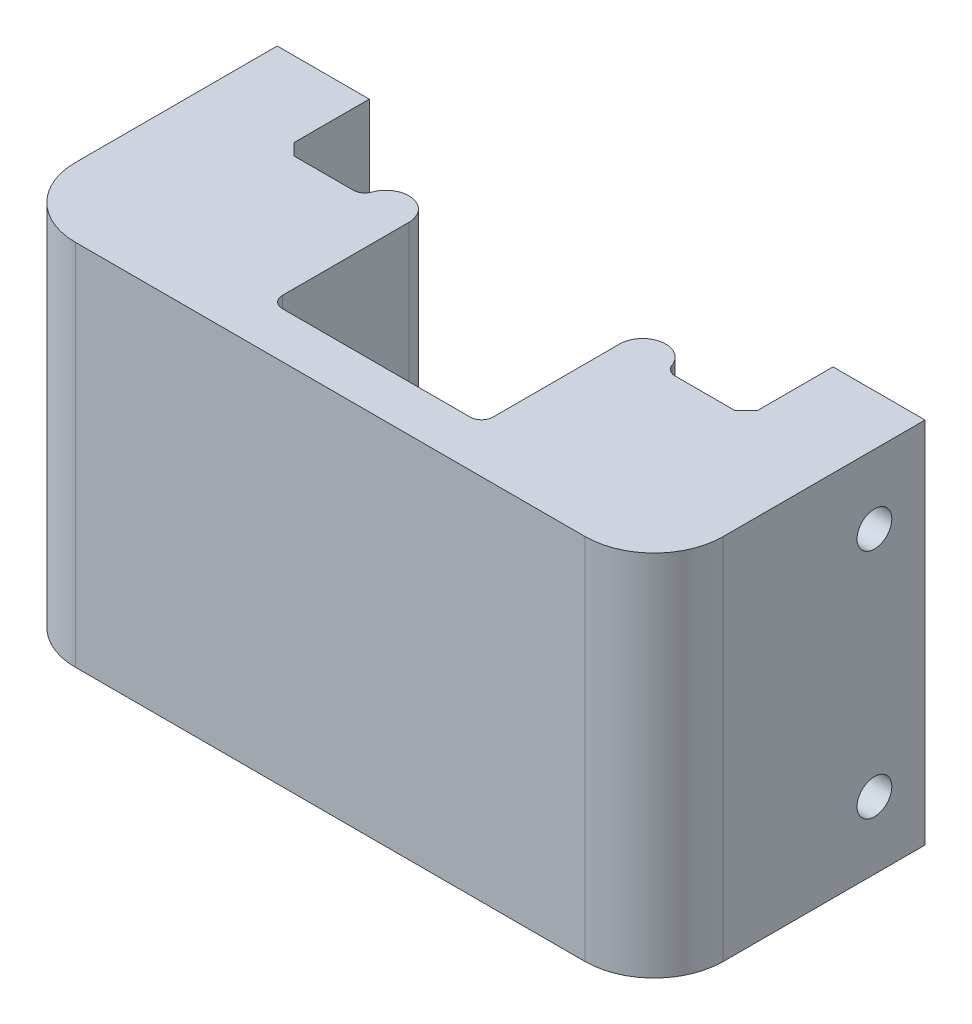
ISO-10303-21;
HEADER;
FILE_DESCRIPTION(('STEP AP214'),'2;1');
FILE_NAME('part.step','',(''),(''),'','','');
FILE_SCHEMA(('AUTOMOTIVE_DESIGN { 1 0 10303 214 1 1 1 1 }'));
ENDSEC;
DATA;
#1=APPLICATION_CONTEXT('core data for automotive mechanical design processes');
#2=APPLICATION_PROTOCOL_DEFINITION('international standard','automotive_design',2000,#1);
#3=PRODUCT_CONTEXT('',#1,'mechanical');
#4=PRODUCT('Part','Part','',(#3));
#5=PRODUCT_RELATED_PRODUCT_CATEGORY('part','',(#4));
#6=PRODUCT_DEFINITION_FORMATION('','',#4);
#7=PRODUCT_DEFINITION_CONTEXT('part definition',#1,'design');
#8=PRODUCT_DEFINITION('design','',#6,#7);
#9=PRODUCT_DEFINITION_SHAPE('','',#8);
#10=(LENGTH_UNIT() NAMED_UNIT(*) SI_UNIT(.MILLI.,.METRE.));
#11=(NAMED_UNIT(*) PLANE_ANGLE_UNIT() SI_UNIT($,.RADIAN.));
#12=(NAMED_UNIT(*) SI_UNIT($,.STERADIAN.) SOLID_ANGLE_UNIT());
#13=UNCERTAINTY_MEASURE_WITH_UNIT(LENGTH_MEASURE(1.E-05),#10,'distance_accuracy_value','');
#14=(GEOMETRIC_REPRESENTATION_CONTEXT(3) GLOBAL_UNCERTAINTY_ASSIGNED_CONTEXT((#13)) GLOBAL_UNIT_ASSIGNED_CONTEXT((#10,
#11,#12)) REPRESENTATION_CONTEXT('',''));
#15=CARTESIAN_POINT('',(0.,0.,0.));
#16=DIRECTION('',(0.,0.,1.));
#17=DIRECTION('',(1.,0.,0.));
#18=AXIS2_PLACEMENT_3D('',#15,#16,#17);
#19=CARTESIAN_POINT('',(24.86025,0.,0.));
#20=DIRECTION('',(0.,-1.,0.));
#21=DIRECTION('',(0.,0.,-1.));
#22=AXIS2_PLACEMENT_3D('',#19,#20,#21);
#23=CYLINDRICAL_SURFACE('',#22,1.5875);
#24=CARTESIAN_POINT('',(24.86025,25.4,0.));
#25=DIRECTION('',(0.,1.,0.));
#26=DIRECTION('',(0.,0.,1.));
#27=AXIS2_PLACEMENT_3D('',#24,#25,#26);
#28=CIRCLE('',#27,1.5875);
#29=CARTESIAN_POINT('',(26.3569593535115,25.4,-0.529166666666667));
#30=VERTEX_POINT('',#29);
#31=CARTESIAN_POINT('',(23.27275,25.4,0.));
#32=VERTEX_POINT('',#31);
#33=EDGE_CURVE('E342',#30,#32,#28,.T.);
#34=ORIENTED_EDGE('',*,*,#33,.F.);
#35=DIRECTION('',(0.,-1.,0.));
#36=VECTOR('',#35,1.);
#37=CARTESIAN_POINT('',(26.3569593535115,0.,-0.529166666666667));
#38=LINE('',#37,#36);
#39=CARTESIAN_POINT('',(26.3569593535115,0.,-0.529166666666667));
#40=VERTEX_POINT('',#39);
#41=EDGE_CURVE('E349',#30,#40,#38,.T.);
#42=ORIENTED_EDGE('',*,*,#41,.T.);
#43=CARTESIAN_POINT('',(24.86025,0.,0.));
#44=DIRECTION('',(0.,1.,0.));
#45=DIRECTION('',(0.,0.,1.));
#46=AXIS2_PLACEMENT_3D('',#43,#44,#45);
#47=CIRCLE('',#46,1.5875);
#48=CARTESIAN_POINT('',(23.27275,0.,0.));
#49=VERTEX_POINT('',#48);
#50=EDGE_CURVE('E340',#49,#40,#47,.F.);
#51=ORIENTED_EDGE('',*,*,#50,.F.);
#52=DIRECTION('',(0.,1.,0.));
#53=VECTOR('',#52,1.);
#54=CARTESIAN_POINT('',(23.27275,0.,0.));
#55=LINE('',#54,#53);
#56=EDGE_CURVE('E337',#32,#49,#55,.F.);
#57=ORIENTED_EDGE('',*,*,#56,.F.);
#58=EDGE_LOOP('',(#34,#42,#51,#57));
#59=FACE_BOUND('',#58,.T.);
#60=ADVANCED_FACE('F38',(#59),#23,.T.);
#61=CARTESIAN_POINT('',(7.14375,25.4,0.));
#62=DIRECTION('',(0.,-1.,0.));
#63=DIRECTION('',(0.,0.,-1.));
#64=AXIS2_PLACEMENT_3D('',#61,#62,#63);
#65=CYLINDRICAL_SURFACE('',#64,1.5875);
#66=CARTESIAN_POINT('',(7.14375,0.,0.));
#67=DIRECTION('',(0.,1.,0.));
#68=DIRECTION('',(0.,0.,1.));
#69=AXIS2_PLACEMENT_3D('',#66,#67,#68);
#70=CIRCLE('',#69,1.5875);
#71=CARTESIAN_POINT('',(5.64704064648847,0.,-0.529166666666667));
#72=VERTEX_POINT('',#71);
#73=CARTESIAN_POINT('',(8.73125,0.,0.));
#74=VERTEX_POINT('',#73);
#75=EDGE_CURVE('E335',#72,#74,#70,.F.);
#76=ORIENTED_EDGE('',*,*,#75,.F.);
#77=DIRECTION('',(0.,-1.,0.));
#78=VECTOR('',#77,1.);
#79=CARTESIAN_POINT('',(5.64704064648847,25.4,-0.529166666666667));
#80=LINE('',#79,#78);
#81=CARTESIAN_POINT('',(5.64704064648847,25.4,-0.529166666666667));
#82=VERTEX_POINT('',#81);
#83=EDGE_CURVE('E347',#72,#82,#80,.F.);
#84=ORIENTED_EDGE('',*,*,#83,.T.);
#85=CARTESIAN_POINT('',(7.14375,25.4,0.));
#86=DIRECTION('',(0.,1.,0.));
#87=DIRECTION('',(0.,0.,1.));
#88=AXIS2_PLACEMENT_3D('',#85,#86,#87);
#89=CIRCLE('',#88,1.5875);
#90=CARTESIAN_POINT('',(8.73125,25.4,0.));
#91=VERTEX_POINT('',#90);
#92=EDGE_CURVE('E332',#91,#82,#89,.T.);
#93=ORIENTED_EDGE('',*,*,#92,.F.);
#94=DIRECTION('',(0.,1.,0.));
#95=VECTOR('',#94,1.);
#96=CARTESIAN_POINT('',(8.73125,25.4,0.));
#97=LINE('',#96,#95);
#98=EDGE_CURVE('E329',#74,#91,#97,.T.);
#99=ORIENTED_EDGE('',*,*,#98,.F.);
#100=EDGE_LOOP('',(#76,#84,#93,#99));
#101=FACE_BOUND('',#100,.T.);
#102=ADVANCED_FACE('F372',(#101),#65,.T.);
#103=CARTESIAN_POINT('',(0.,25.4,12.7));
#104=DIRECTION('',(0.,0.,-1.));
#105=DIRECTION('',(-1.,0.,0.));
#106=AXIS2_PLACEMENT_3D('',#103,#104,#105);
#107=PLANE('',#106);
#108=DIRECTION('',(1.,0.,0.));
#109=VECTOR('',#108,1.);
#110=CARTESIAN_POINT('',(0.,0.,12.7));
#111=LINE('',#110,#109);
#112=CARTESIAN_POINT('',(-1.5875,0.,12.7));
#113=VERTEX_POINT('',#112);
#114=CARTESIAN_POINT('',(33.5915,0.,12.7));
#115=VERTEX_POINT('',#114);
#116=EDGE_CURVE('E244',#113,#115,#111,.T.);
#117=ORIENTED_EDGE('',*,*,#116,.T.);
#118=DIRECTION('',(0.,-1.,0.));
#119=VECTOR('',#118,1.);
#120=CARTESIAN_POINT('',(33.5915,25.4,12.7));
#121=LINE('',#120,#119);
#122=CARTESIAN_POINT('',(33.5915,25.4,12.7));
#123=VERTEX_POINT('',#122);
#124=EDGE_CURVE('E322',#115,#123,#121,.F.);
#125=ORIENTED_EDGE('',*,*,#124,.T.);
#126=DIRECTION('',(1.,0.,0.));
#127=VECTOR('',#126,1.);
#128=CARTESIAN_POINT('',(0.,25.4,12.7));
#129=LINE('',#128,#127);
#130=CARTESIAN_POINT('',(-1.5875,25.4,12.7));
#131=VERTEX_POINT('',#130);
#132=EDGE_CURVE('E208',#131,#123,#129,.T.);
#133=ORIENTED_EDGE('',*,*,#132,.F.);
#134=DIRECTION('',(0.,-1.,0.));
#135=VECTOR('',#134,1.);
#136=CARTESIAN_POINT('',(-1.5875,25.4,12.7));
#137=LINE('',#136,#135);
#138=EDGE_CURVE('E319',#131,#113,#137,.T.);
#139=ORIENTED_EDGE('',*,*,#138,.T.);
#140=EDGE_LOOP('',(#117,#125,#133,#139));
#141=FACE_BOUND('',#140,.T.);
#142=ADVANCED_FACE('F412',(#141),#107,.F.);
#143=CARTESIAN_POINT('',(38.354,25.4,0.));
#144=DIRECTION('',(1.,0.,0.));
#145=DIRECTION('',(0.,0.,-1.));
#146=AXIS2_PLACEMENT_3D('',#143,#144,#145);
#147=PLANE('',#146);
#148=CARTESIAN_POINT('',(38.354,4.63906250000029,-2.49999999999964));
#149=DIRECTION('',(-1.,0.,0.));
#150=DIRECTION('',(0.,0.,1.));
#151=AXIS2_PLACEMENT_3D('',#148,#149,#150);
#152=CIRCLE('',#151,1.2);
#153=CARTESIAN_POINT('',(38.354,4.63906250000029,-1.29999999999965));
#154=VERTEX_POINT('',#153);
#155=EDGE_CURVE('E540',#154,#154,#152,.T.);
#156=ORIENTED_EDGE('',*,*,#155,.T.);
#157=EDGE_LOOP('',(#156));
#158=FACE_BOUND('',#157,.T.);
#159=CARTESIAN_POINT('',(38.354,20.6390625000002,-2.49999999999957));
#160=DIRECTION('',(-1.,0.,0.));
#161=DIRECTION('',(0.,0.,1.));
#162=AXIS2_PLACEMENT_3D('',#159,#160,#161);
#163=CIRCLE('',#162,1.2);
#164=CARTESIAN_POINT('',(38.354,20.6390625000002,-1.29999999999957));
#165=VERTEX_POINT('',#164);
#166=EDGE_CURVE('E534',#165,#165,#163,.T.);
#167=ORIENTED_EDGE('',*,*,#166,.T.);
#168=EDGE_LOOP('',(#167));
#169=FACE_BOUND('',#168,.T.);
#170=DIRECTION('',(0.,0.,1.));
#171=VECTOR('',#170,1.);
#172=CARTESIAN_POINT('',(38.354,25.4,0.));
#173=LINE('',#172,#171);
#174=CARTESIAN_POINT('',(38.354,25.4,-5.9944));
#175=VERTEX_POINT('',#174);
#176=CARTESIAN_POINT('',(38.354,25.4,7.9375));
#177=VERTEX_POINT('',#176);
#178=EDGE_CURVE('E189',#175,#177,#173,.T.);
#179=ORIENTED_EDGE('',*,*,#178,.T.);
#180=DIRECTION('',(0.,-1.,0.));
#181=VECTOR('',#180,1.);
#182=CARTESIAN_POINT('',(38.354,0.,7.9375));
#183=LINE('',#182,#181);
#184=CARTESIAN_POINT('',(38.354,0.,7.9375));
#185=VERTEX_POINT('',#184);
#186=EDGE_CURVE('E313',#177,#185,#183,.T.);
#187=ORIENTED_EDGE('',*,*,#186,.T.);
#188=DIRECTION('',(0.,0.,1.));
#189=VECTOR('',#188,1.);
#190=CARTESIAN_POINT('',(38.354,0.,0.));
#191=LINE('',#190,#189);
#192=CARTESIAN_POINT('',(38.354,0.,-5.9944));
#193=VERTEX_POINT('',#192);
#194=EDGE_CURVE('E192',#193,#185,#191,.T.);
#195=ORIENTED_EDGE('',*,*,#194,.F.);
#196=DIRECTION('',(0.,-1.,0.));
#197=VECTOR('',#196,1.);
#198=CARTESIAN_POINT('',(38.354,25.4,-5.9944));
#199=LINE('',#198,#197);
#200=EDGE_CURVE('E185',#175,#193,#199,.T.);
#201=ORIENTED_EDGE('',*,*,#200,.F.);
#202=EDGE_LOOP('',(#179,#187,#195,#201));
#203=FACE_BOUND('',#202,.T.);
#204=ADVANCED_FACE('F187',(#158,#169,#203),#147,.T.);
#205=CARTESIAN_POINT('',(0.,25.4,-5.9944));
#206=DIRECTION('',(0.,0.,-1.));
#207=DIRECTION('',(-1.,0.,0.));
#208=AXIS2_PLACEMENT_3D('',#205,#206,#207);
#209=PLANE('',#208);
#210=DIRECTION('',(1.,0.,0.));
#211=VECTOR('',#210,1.);
#212=CARTESIAN_POINT('',(0.,0.,-5.9944));
#213=LINE('',#212,#211);
#214=CARTESIAN_POINT('',(32.004,0.,-5.9944));
#215=VERTEX_POINT('',#214);
#216=EDGE_CURVE('E249',#215,#193,#213,.T.);
#217=ORIENTED_EDGE('',*,*,#216,.F.);
#218=DIRECTION('',(0.,-1.,0.));
#219=VECTOR('',#218,1.);
#220=CARTESIAN_POINT('',(32.004,25.4,-5.9944));
#221=LINE('',#220,#219);
#222=CARTESIAN_POINT('',(32.004,25.4,-5.9944));
#223=VERTEX_POINT('',#222);
#224=EDGE_CURVE('E198',#223,#215,#221,.T.);
#225=ORIENTED_EDGE('',*,*,#224,.F.);
#226=DIRECTION('',(1.,0.,0.));
#227=VECTOR('',#226,1.);
#228=CARTESIAN_POINT('',(0.,25.4,-5.9944));
#229=LINE('',#228,#227);
#230=EDGE_CURVE('E204',#223,#175,#229,.T.);
#231=ORIENTED_EDGE('',*,*,#230,.T.);
#232=ORIENTED_EDGE('',*,*,#200,.T.);
#233=EDGE_LOOP('',(#217,#225,#231,#232));
#234=FACE_BOUND('',#233,.T.);
#235=ADVANCED_FACE('F211',(#234),#209,.T.);
#236=CARTESIAN_POINT('',(32.004,25.4,0.));
#237=DIRECTION('',(-1.,0.,0.));
#238=DIRECTION('',(0.,0.,1.));
#239=AXIS2_PLACEMENT_3D('',#236,#237,#238);
#240=PLANE('',#239);
#241=CARTESIAN_POINT('',(32.004,4.63906250000029,-2.49999999999964));
#242=DIRECTION('',(-1.,0.,0.));
#243=DIRECTION('',(0.,0.,1.));
#244=AXIS2_PLACEMENT_3D('',#241,#242,#243);
#245=CIRCLE('',#244,1.2);
#246=CARTESIAN_POINT('',(32.004,4.63906250000029,-1.29999999999965));
#247=VERTEX_POINT('',#246);
#248=EDGE_CURVE('E543',#247,#247,#245,.T.);
#249=ORIENTED_EDGE('',*,*,#248,.F.);
#250=EDGE_LOOP('',(#249));
#251=FACE_BOUND('',#250,.T.);
#252=CARTESIAN_POINT('',(32.004,20.6390625000002,-2.49999999999957));
#253=DIRECTION('',(-1.,0.,0.));
#254=DIRECTION('',(0.,0.,1.));
#255=AXIS2_PLACEMENT_3D('',#252,#253,#254);
#256=CIRCLE('',#255,1.2);
#257=CARTESIAN_POINT('',(32.004,20.6390625000002,-1.29999999999957));
#258=VERTEX_POINT('',#257);
#259=EDGE_CURVE('E537',#258,#258,#256,.T.);
#260=ORIENTED_EDGE('',*,*,#259,.F.);
#261=EDGE_LOOP('',(#260));
#262=FACE_BOUND('',#261,.T.);
#263=DIRECTION('',(0.,0.,-1.));
#264=VECTOR('',#263,1.);
#265=CARTESIAN_POINT('',(32.004,0.,0.));
#266=LINE('',#265,#264);
#267=CARTESIAN_POINT('',(32.004,0.,-0.793750000000003));
#268=VERTEX_POINT('',#267);
#269=EDGE_CURVE('E251',#268,#215,#266,.T.);
#270=ORIENTED_EDGE('',*,*,#269,.F.);
#271=DIRECTION('',(0.,1.,0.));
#272=VECTOR('',#271,1.);
#273=CARTESIAN_POINT('',(32.004,25.4,-0.793750000000003));
#274=LINE('',#273,#272);
#275=CARTESIAN_POINT('',(32.004,25.4,-0.793750000000003));
#276=VERTEX_POINT('',#275);
#277=EDGE_CURVE('E295',#268,#276,#274,.T.);
#278=ORIENTED_EDGE('',*,*,#277,.T.);
#279=DIRECTION('',(0.,0.,-1.));
#280=VECTOR('',#279,1.);
#281=CARTESIAN_POINT('',(32.004,25.4,0.));
#282=LINE('',#281,#280);
#283=EDGE_CURVE('E213',#276,#223,#282,.T.);
#284=ORIENTED_EDGE('',*,*,#283,.T.);
#285=ORIENTED_EDGE('',*,*,#224,.T.);
#286=EDGE_LOOP('',(#270,#278,#284,#285));
#287=FACE_BOUND('',#286,.T.);
#288=ADVANCED_FACE('F407',(#251,#262,#287),#240,.T.);
#289=CARTESIAN_POINT('',(0.,25.4,0.));
#290=DIRECTION('',(0.,0.,-1.));
#291=DIRECTION('',(-1.,0.,0.));
#292=AXIS2_PLACEMENT_3D('',#289,#290,#291);
#293=PLANE('',#292);
#294=DIRECTION('',(1.,0.,0.));
#295=VECTOR('',#294,1.);
#296=CARTESIAN_POINT('',(0.,0.,0.));
#297=LINE('',#296,#295);
#298=CARTESIAN_POINT('',(27.1053140302673,0.,0.));
#299=VERTEX_POINT('',#298);
#300=CARTESIAN_POINT('',(31.21025,0.,0.));
#301=VERTEX_POINT('',#300);
#302=EDGE_CURVE('E253',#299,#301,#297,.T.);
#303=ORIENTED_EDGE('',*,*,#302,.F.);
#304=DIRECTION('',(0.,1.,0.));
#305=VECTOR('',#304,1.);
#306=CARTESIAN_POINT('',(27.1053140302673,25.4,0.));
#307=LINE('',#306,#305);
#308=CARTESIAN_POINT('',(27.1053140302673,25.4,0.));
#309=VERTEX_POINT('',#308);
#310=EDGE_CURVE('E59',#299,#309,#307,.T.);
#311=ORIENTED_EDGE('',*,*,#310,.T.);
#312=DIRECTION('',(1.,0.,0.));
#313=VECTOR('',#312,1.);
#314=CARTESIAN_POINT('',(0.,25.4,0.));
#315=LINE('',#314,#313);
#316=CARTESIAN_POINT('',(31.21025,25.4,0.));
#317=VERTEX_POINT('',#316);
#318=EDGE_CURVE('E215',#309,#317,#315,.T.);
#319=ORIENTED_EDGE('',*,*,#318,.T.);
#320=DIRECTION('',(0.,-1.,0.));
#321=VECTOR('',#320,1.);
#322=CARTESIAN_POINT('',(31.21025,0.,0.));
#323=LINE('',#322,#321);
#324=EDGE_CURVE('E197',#317,#301,#323,.T.);
#325=ORIENTED_EDGE('',*,*,#324,.T.);
#326=EDGE_LOOP('',(#303,#311,#319,#325));
#327=FACE_BOUND('',#326,.T.);
#328=ADVANCED_FACE('F400',(#327),#293,.T.);
#329=CARTESIAN_POINT('',(23.27275,25.4,0.));
#330=DIRECTION('',(-1.,0.,0.));
#331=DIRECTION('',(0.,0.,1.));
#332=AXIS2_PLACEMENT_3D('',#329,#330,#331);
#333=PLANE('',#332);
#334=DIRECTION('',(0.,0.,-1.));
#335=VECTOR('',#334,1.);
#336=CARTESIAN_POINT('',(23.27275,25.4,0.));
#337=LINE('',#336,#335);
#338=CARTESIAN_POINT('',(23.27275,25.4,8.73125));
#339=VERTEX_POINT('',#338);
#340=EDGE_CURVE('E220',#339,#32,#337,.T.);
#341=ORIENTED_EDGE('',*,*,#340,.T.);
#342=ORIENTED_EDGE('',*,*,#56,.T.);
#343=DIRECTION('',(0.,0.,-1.));
#344=VECTOR('',#343,1.);
#345=CARTESIAN_POINT('',(23.27275,0.,0.));
#346=LINE('',#345,#344);
#347=CARTESIAN_POINT('',(23.27275,0.,8.73125));
#348=VERTEX_POINT('',#347);
#349=EDGE_CURVE('E255',#348,#49,#346,.T.);
#350=ORIENTED_EDGE('',*,*,#349,.F.);
#351=DIRECTION('',(0.,-1.,0.));
#352=VECTOR('',#351,1.);
#353=CARTESIAN_POINT('',(23.27275,25.4,8.73125));
#354=LINE('',#353,#352);
#355=EDGE_CURVE('E290',#339,#348,#354,.T.);
#356=ORIENTED_EDGE('',*,*,#355,.F.);
#357=EDGE_LOOP('',(#341,#342,#350,#356));
#358=FACE_BOUND('',#357,.T.);
#359=ADVANCED_FACE('F390',(#358),#333,.T.);
#360=CARTESIAN_POINT('',(22.479,25.4,8.73125));
#361=DIRECTION('',(0.,-1.,0.));
#362=DIRECTION('',(0.,0.,-1.));
#363=AXIS2_PLACEMENT_3D('',#360,#361,#362);
#364=CYLINDRICAL_SURFACE('',#363,0.793750000000001);
#365=CARTESIAN_POINT('',(22.479,0.,8.73125));
#366=DIRECTION('',(0.,1.,0.));
#367=DIRECTION('',(0.,0.,1.));
#368=AXIS2_PLACEMENT_3D('',#365,#366,#367);
#369=CIRCLE('',#368,0.793750000000001);
#370=CARTESIAN_POINT('',(22.479,0.,9.525));
#371=VERTEX_POINT('',#370);
#372=EDGE_CURVE('E258',#371,#348,#369,.T.);
#373=ORIENTED_EDGE('',*,*,#372,.F.);
#374=DIRECTION('',(0.,-1.,0.));
#375=VECTOR('',#374,1.);
#376=CARTESIAN_POINT('',(22.479,25.4,9.525));
#377=LINE('',#376,#375);
#378=CARTESIAN_POINT('',(22.479,25.4,9.525));
#379=VERTEX_POINT('',#378);
#380=EDGE_CURVE('E288',#379,#371,#377,.T.);
#381=ORIENTED_EDGE('',*,*,#380,.F.);
#382=CARTESIAN_POINT('',(22.479,25.4,8.73125));
#383=DIRECTION('',(0.,1.,0.));
#384=DIRECTION('',(0.,0.,1.));
#385=AXIS2_PLACEMENT_3D('',#382,#383,#384);
#386=CIRCLE('',#385,0.793750000000001);
#387=EDGE_CURVE('E223',#379,#339,#386,.T.);
#388=ORIENTED_EDGE('',*,*,#387,.T.);
#389=ORIENTED_EDGE('',*,*,#355,.T.);
#390=EDGE_LOOP('',(#373,#381,#388,#389));
#391=FACE_BOUND('',#390,.T.);
#392=ADVANCED_FACE('F387',(#391),#364,.F.);
#393=CARTESIAN_POINT('',(0.,25.4,9.525));
#394=DIRECTION('',(0.,0.,-1.));
#395=DIRECTION('',(-1.,0.,0.));
#396=AXIS2_PLACEMENT_3D('',#393,#394,#395);
#397=PLANE('',#396);
#398=DIRECTION('',(1.,0.,0.));
#399=VECTOR('',#398,1.);
#400=CARTESIAN_POINT('',(0.,0.,9.525));
#401=LINE('',#400,#399);
#402=CARTESIAN_POINT('',(9.525,0.,9.525));
#403=VERTEX_POINT('',#402);
#404=EDGE_CURVE('E261',#403,#371,#401,.T.);
#405=ORIENTED_EDGE('',*,*,#404,.F.);
#406=DIRECTION('',(0.,-1.,0.));
#407=VECTOR('',#406,1.);
#408=CARTESIAN_POINT('',(9.525,25.4,9.525));
#409=LINE('',#408,#407);
#410=CARTESIAN_POINT('',(9.525,25.4,9.525));
#411=VERTEX_POINT('',#410);
#412=EDGE_CURVE('E286',#411,#403,#409,.T.);
#413=ORIENTED_EDGE('',*,*,#412,.F.);
#414=DIRECTION('',(1.,0.,0.));
#415=VECTOR('',#414,1.);
#416=CARTESIAN_POINT('',(0.,25.4,9.525));
#417=LINE('',#416,#415);
#418=EDGE_CURVE('E226',#411,#379,#417,.T.);
#419=ORIENTED_EDGE('',*,*,#418,.T.);
#420=ORIENTED_EDGE('',*,*,#380,.T.);
#421=EDGE_LOOP('',(#405,#413,#419,#420));
#422=FACE_BOUND('',#421,.T.);
#423=ADVANCED_FACE('F381',(#422),#397,.T.);
#424=CARTESIAN_POINT('',(9.525,25.4,8.73125));
#425=DIRECTION('',(0.,-1.,0.));
#426=DIRECTION('',(0.,0.,-1.));
#427=AXIS2_PLACEMENT_3D('',#424,#425,#426);
#428=CYLINDRICAL_SURFACE('',#427,0.793749999999999);
#429=CARTESIAN_POINT('',(9.525,0.,8.73125));
#430=DIRECTION('',(0.,1.,0.));
#431=DIRECTION('',(0.,0.,1.));
#432=AXIS2_PLACEMENT_3D('',#429,#430,#431);
#433=CIRCLE('',#432,0.793749999999999);
#434=CARTESIAN_POINT('',(8.73125,0.,8.73125));
#435=VERTEX_POINT('',#434);
#436=EDGE_CURVE('E264',#403,#435,#433,.F.);
#437=ORIENTED_EDGE('',*,*,#436,.T.);
#438=DIRECTION('',(0.,-1.,0.));
#439=VECTOR('',#438,1.);
#440=CARTESIAN_POINT('',(8.73125,25.4,8.73125));
#441=LINE('',#440,#439);
#442=CARTESIAN_POINT('',(8.73125,25.4,8.73125));
#443=VERTEX_POINT('',#442);
#444=EDGE_CURVE('E283',#443,#435,#441,.T.);
#445=ORIENTED_EDGE('',*,*,#444,.F.);
#446=CARTESIAN_POINT('',(9.525,25.4,8.73125));
#447=DIRECTION('',(0.,1.,0.));
#448=DIRECTION('',(0.,0.,1.));
#449=AXIS2_PLACEMENT_3D('',#446,#447,#448);
#450=CIRCLE('',#449,0.793749999999999);
#451=EDGE_CURVE('E229',#411,#443,#450,.F.);
#452=ORIENTED_EDGE('',*,*,#451,.F.);
#453=ORIENTED_EDGE('',*,*,#412,.T.);
#454=EDGE_LOOP('',(#437,#445,#452,#453));
#455=FACE_BOUND('',#454,.T.);
#456=ADVANCED_FACE('F483',(#455),#428,.F.);
#457=CARTESIAN_POINT('',(8.73125,25.4,0.));
#458=DIRECTION('',(-1.,0.,0.));
#459=DIRECTION('',(0.,0.,1.));
#460=AXIS2_PLACEMENT_3D('',#457,#458,#459);
#461=PLANE('',#460);
#462=DIRECTION('',(0.,0.,-1.));
#463=VECTOR('',#462,1.);
#464=CARTESIAN_POINT('',(8.73125,0.,0.));
#465=LINE('',#464,#463);
#466=EDGE_CURVE('E266',#435,#74,#465,.T.);
#467=ORIENTED_EDGE('',*,*,#466,.T.);
#468=ORIENTED_EDGE('',*,*,#98,.T.);
#469=DIRECTION('',(0.,0.,-1.));
#470=VECTOR('',#469,1.);
#471=CARTESIAN_POINT('',(8.73125,25.4,0.));
#472=LINE('',#471,#470);
#473=EDGE_CURVE('E231',#443,#91,#472,.T.);
#474=ORIENTED_EDGE('',*,*,#473,.F.);
#475=ORIENTED_EDGE('',*,*,#444,.T.);
#476=EDGE_LOOP('',(#467,#468,#474,#475));
#477=FACE_BOUND('',#476,.T.);
#478=ADVANCED_FACE('F375',(#477),#461,.F.);
#479=CARTESIAN_POINT('',(0.,25.4,0.));
#480=DIRECTION('',(0.,0.,1.));
#481=DIRECTION('',(1.,0.,0.));
#482=AXIS2_PLACEMENT_3D('',#479,#480,#481);
#483=PLANE('',#482);
#484=DIRECTION('',(-1.,0.,0.));
#485=VECTOR('',#484,1.);
#486=CARTESIAN_POINT('',(0.,25.4,0.));
#487=LINE('',#486,#485);
#488=CARTESIAN_POINT('',(4.89868596973271,25.4,0.));
#489=VERTEX_POINT('',#488);
#490=CARTESIAN_POINT('',(0.793750000000003,25.4,0.));
#491=VERTEX_POINT('',#490);
#492=EDGE_CURVE('E234',#489,#491,#487,.T.);
#493=ORIENTED_EDGE('',*,*,#492,.F.);
#494=DIRECTION('',(0.,-1.,0.));
#495=VECTOR('',#494,1.);
#496=CARTESIAN_POINT('',(4.89868596973271,25.4,0.));
#497=LINE('',#496,#495);
#498=CARTESIAN_POINT('',(4.89868596973271,0.,0.));
#499=VERTEX_POINT('',#498);
#500=EDGE_CURVE('E344',#489,#499,#497,.T.);
#501=ORIENTED_EDGE('',*,*,#500,.T.);
#502=DIRECTION('',(-1.,0.,0.));
#503=VECTOR('',#502,1.);
#504=CARTESIAN_POINT('',(0.,0.,0.));
#505=LINE('',#504,#503);
#506=CARTESIAN_POINT('',(0.793750000000003,0.,0.));
#507=VERTEX_POINT('',#506);
#508=EDGE_CURVE('E269',#499,#507,#505,.T.);
#509=ORIENTED_EDGE('',*,*,#508,.T.);
#510=DIRECTION('',(0.,1.,0.));
#511=VECTOR('',#510,1.);
#512=CARTESIAN_POINT('',(0.793750000000003,25.4,0.));
#513=LINE('',#512,#511);
#514=EDGE_CURVE('E300',#507,#491,#513,.T.);
#515=ORIENTED_EDGE('',*,*,#514,.T.);
#516=EDGE_LOOP('',(#493,#501,#509,#515));
#517=FACE_BOUND('',#516,.T.);
#518=ADVANCED_FACE('F362',(#517),#483,.F.);
#519=CARTESIAN_POINT('',(0.,25.4,0.));
#520=DIRECTION('',(-1.,0.,0.));
#521=DIRECTION('',(0.,0.,1.));
#522=AXIS2_PLACEMENT_3D('',#519,#520,#521);
#523=PLANE('',#522);
#524=CARTESIAN_POINT('',(0.,20.6390625000005,-2.5));
#525=DIRECTION('',(1.,0.,0.));
#526=DIRECTION('',(0.,0.,-1.));
#527=AXIS2_PLACEMENT_3D('',#524,#525,#526);
#528=CIRCLE('',#527,1.2);
#529=CARTESIAN_POINT('',(0.,20.6390625000005,-3.7));
#530=VERTEX_POINT('',#529);
#531=EDGE_CURVE('E531',#530,#530,#528,.T.);
#532=ORIENTED_EDGE('',*,*,#531,.F.);
#533=EDGE_LOOP('',(#532));
#534=FACE_BOUND('',#533,.T.);
#535=CARTESIAN_POINT('',(0.,4.63906250000026,-2.49999999999995));
#536=DIRECTION('',(1.,0.,0.));
#537=DIRECTION('',(0.,0.,-1.));
#538=AXIS2_PLACEMENT_3D('',#535,#536,#537);
#539=CIRCLE('',#538,1.2);
#540=CARTESIAN_POINT('',(0.,4.63906250000026,-3.69999999999995));
#541=VERTEX_POINT('',#540);
#542=EDGE_CURVE('E525',#541,#541,#539,.T.);
#543=ORIENTED_EDGE('',*,*,#542,.F.);
#544=EDGE_LOOP('',(#543));
#545=FACE_BOUND('',#544,.T.);
#546=DIRECTION('',(0.,0.,-1.));
#547=VECTOR('',#546,1.);
#548=CARTESIAN_POINT('',(0.,25.4,0.));
#549=LINE('',#548,#547);
#550=CARTESIAN_POINT('',(0.,25.4,-0.79375000000001));
#551=VERTEX_POINT('',#550);
#552=CARTESIAN_POINT('',(0.,25.4,-5.9944));
#553=VERTEX_POINT('',#552);
#554=EDGE_CURVE('E236',#551,#553,#549,.T.);
#555=ORIENTED_EDGE('',*,*,#554,.F.);
#556=DIRECTION('',(0.,-1.,0.));
#557=VECTOR('',#556,1.);
#558=CARTESIAN_POINT('',(0.,0.,-0.79375000000001));
#559=LINE('',#558,#557);
#560=CARTESIAN_POINT('',(0.,0.,-0.79375000000001));
#561=VERTEX_POINT('',#560);
#562=EDGE_CURVE('E297',#551,#561,#559,.T.);
#563=ORIENTED_EDGE('',*,*,#562,.T.);
#564=DIRECTION('',(0.,0.,-1.));
#565=VECTOR('',#564,1.);
#566=CARTESIAN_POINT('',(0.,0.,0.));
#567=LINE('',#566,#565);
#568=CARTESIAN_POINT('',(0.,0.,-5.9944));
#569=VERTEX_POINT('',#568);
#570=EDGE_CURVE('E271',#561,#569,#567,.T.);
#571=ORIENTED_EDGE('',*,*,#570,.T.);
#572=DIRECTION('',(0.,-1.,0.));
#573=VECTOR('',#572,1.);
#574=CARTESIAN_POINT('',(0.,25.4,-5.9944));
#575=LINE('',#574,#573);
#576=EDGE_CURVE('E280',#553,#569,#575,.T.);
#577=ORIENTED_EDGE('',*,*,#576,.F.);
#578=EDGE_LOOP('',(#555,#563,#571,#577));
#579=FACE_BOUND('',#578,.T.);
#580=ADVANCED_FACE('F474',(#534,#545,#579),#523,.F.);
#581=CARTESIAN_POINT('',(0.,25.4,-5.9944));
#582=DIRECTION('',(0.,0.,1.));
#583=DIRECTION('',(1.,0.,0.));
#584=AXIS2_PLACEMENT_3D('',#581,#582,#583);
#585=PLANE('',#584);
#586=DIRECTION('',(-1.,0.,0.));
#587=VECTOR('',#586,1.);
#588=CARTESIAN_POINT('',(0.,0.,-5.9944));
#589=LINE('',#588,#587);
#590=CARTESIAN_POINT('',(-6.35,0.,-5.9944));
#591=VERTEX_POINT('',#590);
#592=EDGE_CURVE('E273',#569,#591,#589,.T.);
#593=ORIENTED_EDGE('',*,*,#592,.T.);
#594=DIRECTION('',(0.,-1.,0.));
#595=VECTOR('',#594,1.);
#596=CARTESIAN_POINT('',(-6.35,25.4,-5.9944));
#597=LINE('',#596,#595);
#598=CARTESIAN_POINT('',(-6.35,25.4,-5.9944));
#599=VERTEX_POINT('',#598);
#600=EDGE_CURVE('E243',#599,#591,#597,.T.);
#601=ORIENTED_EDGE('',*,*,#600,.F.);
#602=DIRECTION('',(-1.,0.,0.));
#603=VECTOR('',#602,1.);
#604=CARTESIAN_POINT('',(0.,25.4,-5.9944));
#605=LINE('',#604,#603);
#606=EDGE_CURVE('E238',#553,#599,#605,.T.);
#607=ORIENTED_EDGE('',*,*,#606,.F.);
#608=ORIENTED_EDGE('',*,*,#576,.T.);
#609=EDGE_LOOP('',(#593,#601,#607,#608));
#610=FACE_BOUND('',#609,.T.);
#611=ADVANCED_FACE('F470',(#610),#585,.F.);
#612=CARTESIAN_POINT('',(-6.35,25.4,0.));
#613=DIRECTION('',(1.,0.,0.));
#614=DIRECTION('',(0.,0.,-1.));
#615=AXIS2_PLACEMENT_3D('',#612,#613,#614);
#616=PLANE('',#615);
#617=CARTESIAN_POINT('',(-6.35,20.6390625000005,-2.5));
#618=DIRECTION('',(1.,0.,0.));
#619=DIRECTION('',(0.,0.,-1.));
#620=AXIS2_PLACEMENT_3D('',#617,#618,#619);
#621=CIRCLE('',#620,1.2);
#622=CARTESIAN_POINT('',(-6.35,20.6390625000005,-3.7));
#623=VERTEX_POINT('',#622);
#624=EDGE_CURVE('E528',#623,#623,#621,.T.);
#625=ORIENTED_EDGE('',*,*,#624,.T.);
#626=EDGE_LOOP('',(#625));
#627=FACE_BOUND('',#626,.T.);
#628=CARTESIAN_POINT('',(-6.35,4.63906250000026,-2.49999999999995));
#629=DIRECTION('',(1.,0.,0.));
#630=DIRECTION('',(0.,0.,-1.));
#631=AXIS2_PLACEMENT_3D('',#628,#629,#630);
#632=CIRCLE('',#631,1.2);
#633=CARTESIAN_POINT('',(-6.35,4.63906250000026,-3.69999999999995));
#634=VERTEX_POINT('',#633);
#635=EDGE_CURVE('E247',#634,#634,#632,.T.);
#636=ORIENTED_EDGE('',*,*,#635,.T.);
#637=EDGE_LOOP('',(#636));
#638=FACE_BOUND('',#637,.T.);
#639=DIRECTION('',(0.,0.,1.));
#640=VECTOR('',#639,1.);
#641=CARTESIAN_POINT('',(-6.35,0.,0.));
#642=LINE('',#641,#640);
#643=CARTESIAN_POINT('',(-6.35,0.,7.9375));
#644=VERTEX_POINT('',#643);
#645=EDGE_CURVE('E275',#591,#644,#642,.T.);
#646=ORIENTED_EDGE('',*,*,#645,.T.);
#647=DIRECTION('',(0.,-1.,0.));
#648=VECTOR('',#647,1.);
#649=CARTESIAN_POINT('',(-6.35,25.4,7.9375));
#650=LINE('',#649,#648);
#651=CARTESIAN_POINT('',(-6.35,25.4,7.9375));
#652=VERTEX_POINT('',#651);
#653=EDGE_CURVE('E327',#644,#652,#650,.F.);
#654=ORIENTED_EDGE('',*,*,#653,.T.);
#655=DIRECTION('',(0.,0.,1.));
#656=VECTOR('',#655,1.);
#657=CARTESIAN_POINT('',(-6.35,25.4,0.));
#658=LINE('',#657,#656);
#659=EDGE_CURVE('E240',#599,#652,#658,.T.);
#660=ORIENTED_EDGE('',*,*,#659,.F.);
#661=ORIENTED_EDGE('',*,*,#600,.T.);
#662=EDGE_LOOP('',(#646,#654,#660,#661));
#663=FACE_BOUND('',#662,.T.);
#664=ADVANCED_FACE('F465',(#627,#638,#663),#616,.F.);
#665=CARTESIAN_POINT('',(0.,25.4,0.));
#666=DIRECTION('',(0.,1.,0.));
#667=DIRECTION('',(0.,0.,1.));
#668=AXIS2_PLACEMENT_3D('',#665,#666,#667);
#669=PLANE('',#668);
#670=ORIENTED_EDGE('',*,*,#318,.F.);
#671=CARTESIAN_POINT('',(27.1053140302673,25.4,-0.79375));
#672=DIRECTION('',(0.,1.,0.));
#673=DIRECTION('',(0.,0.,1.));
#674=AXIS2_PLACEMENT_3D('',#671,#672,#673);
#675=CIRCLE('',#674,0.79375);
#676=EDGE_CURVE('E11',#309,#30,#675,.F.);
#677=ORIENTED_EDGE('',*,*,#676,.T.);
#678=ORIENTED_EDGE('',*,*,#33,.T.);
#679=ORIENTED_EDGE('',*,*,#340,.F.);
#680=ORIENTED_EDGE('',*,*,#387,.F.);
#681=ORIENTED_EDGE('',*,*,#418,.F.);
#682=ORIENTED_EDGE('',*,*,#451,.T.);
#683=ORIENTED_EDGE('',*,*,#473,.T.);
#684=ORIENTED_EDGE('',*,*,#92,.T.);
#685=CARTESIAN_POINT('',(4.89868596973271,25.4,-0.79375));
#686=DIRECTION('',(0.,1.,0.));
#687=DIRECTION('',(0.,0.,1.));
#688=AXIS2_PLACEMENT_3D('',#685,#686,#687);
#689=CIRCLE('',#688,0.79375);
#690=EDGE_CURVE('E355',#82,#489,#689,.F.);
#691=ORIENTED_EDGE('',*,*,#690,.T.);
#692=ORIENTED_EDGE('',*,*,#492,.T.);
#693=DIRECTION('',(0.707106781186544,0.,0.707106781186551));
#694=VECTOR('',#693,1.);
#695=CARTESIAN_POINT('',(0.,25.4,-0.79375000000001));
#696=LINE('',#695,#694);
#697=EDGE_CURVE('E311',#491,#551,#696,.F.);
#698=ORIENTED_EDGE('',*,*,#697,.T.);
#699=ORIENTED_EDGE('',*,*,#554,.T.);
#700=ORIENTED_EDGE('',*,*,#606,.T.);
#701=ORIENTED_EDGE('',*,*,#659,.T.);
#702=CARTESIAN_POINT('',(-1.5875,25.4,7.9375));
#703=DIRECTION('',(0.,1.,0.));
#704=DIRECTION('',(0.,0.,1.));
#705=AXIS2_PLACEMENT_3D('',#702,#703,#704);
#706=CIRCLE('',#705,4.7625);
#707=EDGE_CURVE('E324',#652,#131,#706,.T.);
#708=ORIENTED_EDGE('',*,*,#707,.T.);
#709=ORIENTED_EDGE('',*,*,#132,.T.);
#710=CARTESIAN_POINT('',(33.5915,25.4,7.9375));
#711=DIRECTION('',(0.,1.,0.));
#712=DIRECTION('',(0.,0.,1.));
#713=AXIS2_PLACEMENT_3D('',#710,#711,#712);
#714=CIRCLE('',#713,4.7625);
#715=EDGE_CURVE('E207',#123,#177,#714,.T.);
#716=ORIENTED_EDGE('',*,*,#715,.T.);
#717=ORIENTED_EDGE('',*,*,#178,.F.);
#718=ORIENTED_EDGE('',*,*,#230,.F.);
#719=ORIENTED_EDGE('',*,*,#283,.F.);
#720=DIRECTION('',(0.707106781186551,0.,-0.707106781186544));
#721=VECTOR('',#720,1.);
#722=CARTESIAN_POINT('',(31.21025,25.4,0.));
#723=LINE('',#722,#721);
#724=EDGE_CURVE('E305',#276,#317,#723,.F.);
#725=ORIENTED_EDGE('',*,*,#724,.T.);
#726=EDGE_LOOP('',(#670,#677,#678,#679,#680,#681,#682,#683,#684,#691,#692,#698,#699,#700,#701,
#708,#709,#716,#717,#718,#719,#725));
#727=FACE_BOUND('',#726,.T.);
#728=ADVANCED_FACE('F202',(#727),#669,.T.);
#729=CARTESIAN_POINT('',(0.,0.,0.));
#730=DIRECTION('',(0.,1.,0.));
#731=DIRECTION('',(0.,0.,1.));
#732=AXIS2_PLACEMENT_3D('',#729,#730,#731);
#733=PLANE('',#732);
#734=ORIENTED_EDGE('',*,*,#349,.T.);
#735=ORIENTED_EDGE('',*,*,#50,.T.);
#736=CARTESIAN_POINT('',(27.1053140302673,0.,-0.79375));
#737=DIRECTION('',(0.,1.,0.));
#738=DIRECTION('',(0.,0.,1.));
#739=AXIS2_PLACEMENT_3D('',#736,#737,#738);
#740=CIRCLE('',#739,0.79375);
#741=EDGE_CURVE('E46',#40,#299,#740,.T.);
#742=ORIENTED_EDGE('',*,*,#741,.T.);
#743=ORIENTED_EDGE('',*,*,#302,.T.);
#744=DIRECTION('',(-0.707106781186551,0.,0.707106781186544));
#745=VECTOR('',#744,1.);
#746=CARTESIAN_POINT('',(15.6051249999999,0.,15.605125));
#747=LINE('',#746,#745);
#748=EDGE_CURVE('E303',#301,#268,#747,.F.);
#749=ORIENTED_EDGE('',*,*,#748,.T.);
#750=ORIENTED_EDGE('',*,*,#269,.T.);
#751=ORIENTED_EDGE('',*,*,#216,.T.);
#752=ORIENTED_EDGE('',*,*,#194,.T.);
#753=CARTESIAN_POINT('',(33.5915,0.,7.9375));
#754=DIRECTION('',(0.,1.,0.));
#755=DIRECTION('',(0.,0.,1.));
#756=AXIS2_PLACEMENT_3D('',#753,#754,#755);
#757=CIRCLE('',#756,4.7625);
#758=EDGE_CURVE('E317',#185,#115,#757,.F.);
#759=ORIENTED_EDGE('',*,*,#758,.T.);
#760=ORIENTED_EDGE('',*,*,#116,.F.);
#761=CARTESIAN_POINT('',(-1.5875,0.,7.9375));
#762=DIRECTION('',(0.,1.,0.));
#763=DIRECTION('',(0.,0.,1.));
#764=AXIS2_PLACEMENT_3D('',#761,#762,#763);
#765=CIRCLE('',#764,4.7625);
#766=EDGE_CURVE('E315',#113,#644,#765,.F.);
#767=ORIENTED_EDGE('',*,*,#766,.T.);
#768=ORIENTED_EDGE('',*,*,#645,.F.);
#769=ORIENTED_EDGE('',*,*,#592,.F.);
#770=ORIENTED_EDGE('',*,*,#570,.F.);
#771=DIRECTION('',(-0.707106781186544,0.,-0.707106781186551));
#772=VECTOR('',#771,1.);
#773=CARTESIAN_POINT('',(0.396875000000005,0.,-0.396875000000001));
#774=LINE('',#773,#772);
#775=EDGE_CURVE('E308',#561,#507,#774,.F.);
#776=ORIENTED_EDGE('',*,*,#775,.T.);
#777=ORIENTED_EDGE('',*,*,#508,.F.);
#778=CARTESIAN_POINT('',(4.89868596973271,0.,-0.79375));
#779=DIRECTION('',(0.,1.,0.));
#780=DIRECTION('',(0.,0.,1.));
#781=AXIS2_PLACEMENT_3D('',#778,#779,#780);
#782=CIRCLE('',#781,0.79375);
#783=EDGE_CURVE('E353',#499,#72,#782,.T.);
#784=ORIENTED_EDGE('',*,*,#783,.T.);
#785=ORIENTED_EDGE('',*,*,#75,.T.);
#786=ORIENTED_EDGE('',*,*,#466,.F.);
#787=ORIENTED_EDGE('',*,*,#436,.F.);
#788=ORIENTED_EDGE('',*,*,#404,.T.);
#789=ORIENTED_EDGE('',*,*,#372,.T.);
#790=EDGE_LOOP('',(#734,#735,#742,#743,#749,#750,#751,#752,#759,#760,#767,#768,#769,#770,#776,
#777,#784,#785,#786,#787,#788,#789));
#791=FACE_BOUND('',#790,.T.);
#792=ADVANCED_FACE('F368',(#791),#733,.F.);
#793=CARTESIAN_POINT('',(31.21025,25.4,0.));
#794=DIRECTION('',(-0.707106781186544,0.,-0.707106781186551));
#795=DIRECTION('',(0.,1.,0.));
#796=AXIS2_PLACEMENT_3D('',#793,#794,#795);
#797=PLANE('',#796);
#798=ORIENTED_EDGE('',*,*,#724,.F.);
#799=ORIENTED_EDGE('',*,*,#277,.F.);
#800=ORIENTED_EDGE('',*,*,#748,.F.);
#801=ORIENTED_EDGE('',*,*,#324,.F.);
#802=EDGE_LOOP('',(#798,#799,#800,#801));
#803=FACE_BOUND('',#802,.T.);
#804=ADVANCED_FACE('F403',(#803),#797,.T.);
#805=CARTESIAN_POINT('',(0.,25.4,-0.79375000000001));
#806=DIRECTION('',(0.707106781186551,0.,-0.707106781186544));
#807=DIRECTION('',(0.,1.,0.));
#808=AXIS2_PLACEMENT_3D('',#805,#806,#807);
#809=PLANE('',#808);
#810=ORIENTED_EDGE('',*,*,#697,.F.);
#811=ORIENTED_EDGE('',*,*,#514,.F.);
#812=ORIENTED_EDGE('',*,*,#775,.F.);
#813=ORIENTED_EDGE('',*,*,#562,.F.);
#814=EDGE_LOOP('',(#810,#811,#812,#813));
#815=FACE_BOUND('',#814,.T.);
#816=ADVANCED_FACE('F461',(#815),#809,.T.);
#817=CARTESIAN_POINT('',(0.,4.63906250000026,-2.49999999999995));
#818=DIRECTION('',(1.,0.,0.));
#819=DIRECTION('',(0.,0.,-1.));
#820=AXIS2_PLACEMENT_3D('',#817,#818,#819);
#821=CYLINDRICAL_SURFACE('',#820,1.2);
#822=ORIENTED_EDGE('',*,*,#635,.F.);
#823=EDGE_LOOP('',(#822));
#824=FACE_BOUND('',#823,.T.);
#825=ORIENTED_EDGE('',*,*,#542,.T.);
#826=EDGE_LOOP('',(#825));
#827=FACE_BOUND('',#826,.T.);
#828=ADVANCED_FACE('F426',(#824,#827),#821,.F.);
#829=CARTESIAN_POINT('',(0.,20.6390625000005,-2.5));
#830=DIRECTION('',(1.,0.,0.));
#831=DIRECTION('',(0.,0.,-1.));
#832=AXIS2_PLACEMENT_3D('',#829,#830,#831);
#833=CYLINDRICAL_SURFACE('',#832,1.2);
#834=ORIENTED_EDGE('',*,*,#624,.F.);
#835=EDGE_LOOP('',(#834));
#836=FACE_BOUND('',#835,.T.);
#837=ORIENTED_EDGE('',*,*,#531,.T.);
#838=EDGE_LOOP('',(#837));
#839=FACE_BOUND('',#838,.T.);
#840=ADVANCED_FACE('F418',(#836,#839),#833,.F.);
#841=CARTESIAN_POINT('',(33.5915,25.4,7.9375));
#842=DIRECTION('',(0.,1.,0.));
#843=DIRECTION('',(0.,0.,1.));
#844=AXIS2_PLACEMENT_3D('',#841,#842,#843);
#845=CYLINDRICAL_SURFACE('',#844,4.7625);
#846=ORIENTED_EDGE('',*,*,#715,.F.);
#847=ORIENTED_EDGE('',*,*,#124,.F.);
#848=ORIENTED_EDGE('',*,*,#758,.F.);
#849=ORIENTED_EDGE('',*,*,#186,.F.);
#850=EDGE_LOOP('',(#846,#847,#848,#849));
#851=FACE_BOUND('',#850,.T.);
#852=ADVANCED_FACE('F415',(#851),#845,.T.);
#853=CARTESIAN_POINT('',(-1.5875,25.4,7.9375));
#854=DIRECTION('',(0.,-1.,0.));
#855=DIRECTION('',(0.,0.,-1.));
#856=AXIS2_PLACEMENT_3D('',#853,#854,#855);
#857=CYLINDRICAL_SURFACE('',#856,4.7625);
#858=ORIENTED_EDGE('',*,*,#707,.F.);
#859=ORIENTED_EDGE('',*,*,#653,.F.);
#860=ORIENTED_EDGE('',*,*,#766,.F.);
#861=ORIENTED_EDGE('',*,*,#138,.F.);
#862=EDGE_LOOP('',(#858,#859,#860,#861));
#863=FACE_BOUND('',#862,.T.);
#864=ADVANCED_FACE('F417',(#863),#857,.T.);
#865=CARTESIAN_POINT('',(4.89868596973271,25.4,-0.79375));
#866=DIRECTION('',(0.,-1.,0.));
#867=DIRECTION('',(0.,0.,-1.));
#868=AXIS2_PLACEMENT_3D('',#865,#866,#867);
#869=CYLINDRICAL_SURFACE('',#868,0.79375);
#870=ORIENTED_EDGE('',*,*,#690,.F.);
#871=ORIENTED_EDGE('',*,*,#83,.F.);
#872=ORIENTED_EDGE('',*,*,#783,.F.);
#873=ORIENTED_EDGE('',*,*,#500,.F.);
#874=EDGE_LOOP('',(#870,#871,#872,#873));
#875=FACE_BOUND('',#874,.T.);
#876=ADVANCED_FACE('F366',(#875),#869,.F.);
#877=CARTESIAN_POINT('',(27.1053140302673,0.,-0.79375));
#878=DIRECTION('',(0.,-1.,0.));
#879=DIRECTION('',(0.,0.,-1.));
#880=AXIS2_PLACEMENT_3D('',#877,#878,#879);
#881=CYLINDRICAL_SURFACE('',#880,0.79375);
#882=ORIENTED_EDGE('',*,*,#676,.F.);
#883=ORIENTED_EDGE('',*,*,#310,.F.);
#884=ORIENTED_EDGE('',*,*,#741,.F.);
#885=ORIENTED_EDGE('',*,*,#41,.F.);
#886=EDGE_LOOP('',(#882,#883,#884,#885));
#887=FACE_BOUND('',#886,.T.);
#888=ADVANCED_FACE('F40',(#887),#881,.F.);
#889=CARTESIAN_POINT('',(32.004,20.6390625000002,-2.49999999999957));
#890=DIRECTION('',(-1.,0.,0.));
#891=DIRECTION('',(0.,0.,1.));
#892=AXIS2_PLACEMENT_3D('',#889,#890,#891);
#893=CYLINDRICAL_SURFACE('',#892,1.2);
#894=ORIENTED_EDGE('',*,*,#166,.F.);
#895=EDGE_LOOP('',(#894));
#896=FACE_BOUND('',#895,.T.);
#897=ORIENTED_EDGE('',*,*,#259,.T.);
#898=EDGE_LOOP('',(#897));
#899=FACE_BOUND('',#898,.T.);
#900=ADVANCED_FACE('F444',(#896,#899),#893,.F.);
#901=CARTESIAN_POINT('',(32.004,4.63906250000029,-2.49999999999964));
#902=DIRECTION('',(-1.,0.,0.));
#903=DIRECTION('',(0.,0.,1.));
#904=AXIS2_PLACEMENT_3D('',#901,#902,#903);
#905=CYLINDRICAL_SURFACE('',#904,1.2);
#906=ORIENTED_EDGE('',*,*,#155,.F.);
#907=EDGE_LOOP('',(#906));
#908=FACE_BOUND('',#907,.T.);
#909=ORIENTED_EDGE('',*,*,#248,.T.);
#910=EDGE_LOOP('',(#909));
#911=FACE_BOUND('',#910,.T.);
#912=ADVANCED_FACE('F448',(#908,#911),#905,.F.);
#913=CLOSED_SHELL('',(#60,#102,#142,#204,#235,#288,#328,#359,#392,#423,#456,#478,#518,#580,#611,
#664,#728,#792,#804,#816,#828,#840,#852,#864,#876,#888,#900,#912));
#914=MANIFOLD_SOLID_BREP('B2',#913);
#915=ADVANCED_BREP_SHAPE_REPRESENTATION('',(#18,#914),#14);
#916=SHAPE_DEFINITION_REPRESENTATION(#9,#915);
ENDSEC;
END-ISO-10303-21;
